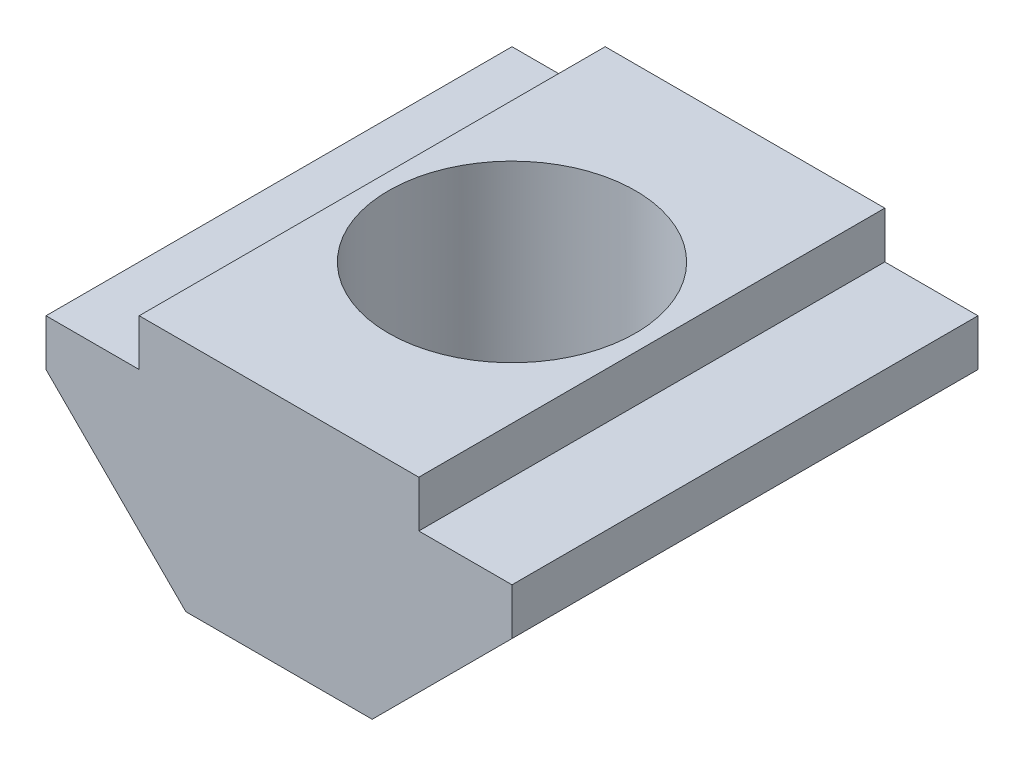
ISO-10303-21;
HEADER;
FILE_DESCRIPTION(('STEP AP214'),'2;1');
FILE_NAME('part.step','',(''),(''),'','','');
FILE_SCHEMA(('AUTOMOTIVE_DESIGN { 1 0 10303 214 1 1 1 1 }'));
ENDSEC;
DATA;
#1=APPLICATION_CONTEXT('core data for automotive mechanical design processes');
#2=APPLICATION_PROTOCOL_DEFINITION('international standard','automotive_design',2000,#1);
#3=PRODUCT_CONTEXT('',#1,'mechanical');
#4=PRODUCT('Part','Part','',(#3));
#5=PRODUCT_RELATED_PRODUCT_CATEGORY('part','',(#4));
#6=PRODUCT_DEFINITION_FORMATION('','',#4);
#7=PRODUCT_DEFINITION_CONTEXT('part definition',#1,'design');
#8=PRODUCT_DEFINITION('design','',#6,#7);
#9=PRODUCT_DEFINITION_SHAPE('','',#8);
#10=(LENGTH_UNIT() NAMED_UNIT(*) SI_UNIT(.MILLI.,.METRE.));
#11=(NAMED_UNIT(*) PLANE_ANGLE_UNIT() SI_UNIT($,.RADIAN.));
#12=(NAMED_UNIT(*) SI_UNIT($,.STERADIAN.) SOLID_ANGLE_UNIT());
#13=UNCERTAINTY_MEASURE_WITH_UNIT(LENGTH_MEASURE(1.E-05),#10,'distance_accuracy_value','');
#14=(GEOMETRIC_REPRESENTATION_CONTEXT(3) GLOBAL_UNCERTAINTY_ASSIGNED_CONTEXT((#13)) GLOBAL_UNIT_ASSIGNED_CONTEXT((#10,
#11,#12)) REPRESENTATION_CONTEXT('',''));
#15=CARTESIAN_POINT('',(0.,0.,0.));
#16=DIRECTION('',(0.,0.,1.));
#17=DIRECTION('',(1.,0.,0.));
#18=AXIS2_PLACEMENT_3D('',#15,#16,#17);
#19=CARTESIAN_POINT('',(0.,-2.50000000000001,-5.));
#20=DIRECTION('',(0.,-1.,0.));
#21=DIRECTION('',(0.,0.,-1.));
#22=AXIS2_PLACEMENT_3D('',#19,#20,#21);
#23=PLANE('',#22);
#24=CARTESIAN_POINT('',(0.,-2.50000000000001,0.));
#25=DIRECTION('',(0.,-1.,0.));
#26=DIRECTION('',(0.,0.,-1.));
#27=AXIS2_PLACEMENT_3D('',#24,#25,#26);
#28=CIRCLE('',#27,2.65);
#29=CARTESIAN_POINT('',(2.00000000000002,-2.50000000000001,1.73853386507134));
#30=VERTEX_POINT('',#29);
#31=CARTESIAN_POINT('',(-2.,-2.50000000000001,1.73853386507136));
#32=VERTEX_POINT('',#31);
#33=EDGE_CURVE('E11',#30,#32,#28,.T.);
#34=ORIENTED_EDGE('',*,*,#33,.F.);
#35=DIRECTION('',(0.,0.,1.));
#36=VECTOR('',#35,1.);
#37=CARTESIAN_POINT('',(2.00000000000002,-2.50000000000001,-5.));
#38=LINE('',#37,#36);
#39=CARTESIAN_POINT('',(2.00000000000002,-2.50000000000001,5.));
#40=VERTEX_POINT('',#39);
#41=EDGE_CURVE('E142',#30,#40,#38,.T.);
#42=ORIENTED_EDGE('',*,*,#41,.T.);
#43=DIRECTION('',(1.,0.,0.));
#44=VECTOR('',#43,1.);
#45=CARTESIAN_POINT('',(0.,-2.50000000000001,5.));
#46=LINE('',#45,#44);
#47=CARTESIAN_POINT('',(-2.,-2.50000000000001,5.));
#48=VERTEX_POINT('',#47);
#49=EDGE_CURVE('E246',#48,#40,#46,.T.);
#50=ORIENTED_EDGE('',*,*,#49,.F.);
#51=DIRECTION('',(0.,0.,1.));
#52=VECTOR('',#51,1.);
#53=CARTESIAN_POINT('',(-2.,-2.50000000000001,-5.));
#54=LINE('',#53,#52);
#55=EDGE_CURVE('E175',#32,#48,#54,.T.);
#56=ORIENTED_EDGE('',*,*,#55,.F.);
#57=EDGE_LOOP('',(#34,#42,#50,#56));
#58=FACE_BOUND('',#57,.T.);
#59=ADVANCED_FACE('F41',(#58),#23,.T.);
#60=CARTESIAN_POINT('',(-2.,-2.50000000000001,-1.73853386507136));
#61=VERTEX_POINT('',#60);
#62=CARTESIAN_POINT('',(2.00000000000002,-2.50000000000001,-1.73853386507134));
#63=VERTEX_POINT('',#62);
#64=EDGE_CURVE('E45',#61,#63,#28,.T.);
#65=ORIENTED_EDGE('',*,*,#64,.F.);
#66=CARTESIAN_POINT('',(-2.,-2.50000000000001,-5.));
#67=VERTEX_POINT('',#66);
#68=EDGE_CURVE('E63',#67,#61,#54,.T.);
#69=ORIENTED_EDGE('',*,*,#68,.F.);
#70=DIRECTION('',(1.,0.,0.));
#71=VECTOR('',#70,1.);
#72=CARTESIAN_POINT('',(0.,-2.50000000000001,-5.));
#73=LINE('',#72,#71);
#74=CARTESIAN_POINT('',(2.00000000000002,-2.50000000000001,-5.));
#75=VERTEX_POINT('',#74);
#76=EDGE_CURVE('E146',#67,#75,#73,.T.);
#77=ORIENTED_EDGE('',*,*,#76,.T.);
#78=EDGE_CURVE('E139',#75,#63,#38,.T.);
#79=ORIENTED_EDGE('',*,*,#78,.T.);
#80=EDGE_LOOP('',(#65,#69,#77,#79));
#81=FACE_BOUND('',#80,.T.);
#82=ADVANCED_FACE('F43',(#81),#23,.T.);
#83=CARTESIAN_POINT('',(-2.25000000000001,-2.25,-5.));
#84=DIRECTION('',(-0.707106781186549,-0.707106781186546,0.));
#85=DIRECTION('',(0.707106781186546,-0.707106781186549,0.));
#86=AXIS2_PLACEMENT_3D('',#83,#84,#85);
#87=PLANE('',#86);
#88=CARTESIAN_POINT('',(0.,-4.50000000000002,0.));
#89=DIRECTION('',(-0.707106781186549,-0.707106781186546,0.));
#90=DIRECTION('',(-0.707106781186546,0.707106781186549,0.));
#91=AXIS2_PLACEMENT_3D('',#88,#89,#90);
#92=ELLIPSE('',#91,3.7476659402887,2.65);
#93=EDGE_CURVE('E56',#32,#61,#92,.T.);
#94=ORIENTED_EDGE('',*,*,#93,.F.);
#95=ORIENTED_EDGE('',*,*,#55,.T.);
#96=DIRECTION('',(0.707106781186546,-0.707106781186549,0.));
#97=VECTOR('',#96,1.);
#98=CARTESIAN_POINT('',(-2.25000000000001,-2.25,5.));
#99=LINE('',#98,#97);
#100=CARTESIAN_POINT('',(-5.,0.499999999999993,5.));
#101=VERTEX_POINT('',#100);
#102=EDGE_CURVE('E210',#101,#48,#99,.T.);
#103=ORIENTED_EDGE('',*,*,#102,.F.);
#104=DIRECTION('',(0.,0.,1.));
#105=VECTOR('',#104,1.);
#106=CARTESIAN_POINT('',(-5.,0.499999999999993,-5.));
#107=LINE('',#106,#105);
#108=CARTESIAN_POINT('',(-5.,0.499999999999993,-5.));
#109=VERTEX_POINT('',#108);
#110=EDGE_CURVE('E172',#109,#101,#107,.T.);
#111=ORIENTED_EDGE('',*,*,#110,.F.);
#112=DIRECTION('',(0.707106781186546,-0.707106781186549,0.));
#113=VECTOR('',#112,1.);
#114=CARTESIAN_POINT('',(-2.25000000000001,-2.25,-5.));
#115=LINE('',#114,#113);
#116=EDGE_CURVE('E153',#109,#67,#115,.T.);
#117=ORIENTED_EDGE('',*,*,#116,.T.);
#118=ORIENTED_EDGE('',*,*,#68,.T.);
#119=EDGE_LOOP('',(#94,#95,#103,#111,#117,#118));
#120=FACE_BOUND('',#119,.T.);
#121=ADVANCED_FACE('F292',(#120),#87,.T.);
#122=CARTESIAN_POINT('',(-5.,0.,-5.));
#123=DIRECTION('',(1.,0.,0.));
#124=DIRECTION('',(0.,0.,-1.));
#125=AXIS2_PLACEMENT_3D('',#122,#123,#124);
#126=PLANE('',#125);
#127=ORIENTED_EDGE('',*,*,#110,.T.);
#128=DIRECTION('',(0.,1.,0.));
#129=VECTOR('',#128,1.);
#130=CARTESIAN_POINT('',(-5.,0.,5.));
#131=LINE('',#130,#129);
#132=CARTESIAN_POINT('',(-5.,1.5,5.));
#133=VERTEX_POINT('',#132);
#134=EDGE_CURVE('E214',#101,#133,#131,.T.);
#135=ORIENTED_EDGE('',*,*,#134,.T.);
#136=DIRECTION('',(0.,0.,1.));
#137=VECTOR('',#136,1.);
#138=CARTESIAN_POINT('',(-5.,1.5,-5.));
#139=LINE('',#138,#137);
#140=CARTESIAN_POINT('',(-5.,1.5,-5.));
#141=VERTEX_POINT('',#140);
#142=EDGE_CURVE('E169',#141,#133,#139,.T.);
#143=ORIENTED_EDGE('',*,*,#142,.F.);
#144=DIRECTION('',(0.,1.,0.));
#145=VECTOR('',#144,1.);
#146=CARTESIAN_POINT('',(-5.,0.,-5.));
#147=LINE('',#146,#145);
#148=EDGE_CURVE('E181',#109,#141,#147,.T.);
#149=ORIENTED_EDGE('',*,*,#148,.F.);
#150=EDGE_LOOP('',(#127,#135,#143,#149));
#151=FACE_BOUND('',#150,.T.);
#152=ADVANCED_FACE('F289',(#151),#126,.F.);
#153=CARTESIAN_POINT('',(0.,1.5,-5.));
#154=DIRECTION('',(0.,1.,0.));
#155=DIRECTION('',(-1.,0.,0.));
#156=AXIS2_PLACEMENT_3D('',#153,#154,#155);
#157=PLANE('',#156);
#158=ORIENTED_EDGE('',*,*,#142,.T.);
#159=DIRECTION('',(-1.,0.,0.));
#160=VECTOR('',#159,1.);
#161=CARTESIAN_POINT('',(0.,1.5,5.));
#162=LINE('',#161,#160);
#163=CARTESIAN_POINT('',(-3.,1.5,5.));
#164=VERTEX_POINT('',#163);
#165=EDGE_CURVE('E218',#164,#133,#162,.T.);
#166=ORIENTED_EDGE('',*,*,#165,.F.);
#167=DIRECTION('',(0.,0.,1.));
#168=VECTOR('',#167,1.);
#169=CARTESIAN_POINT('',(-3.,1.5,-5.));
#170=LINE('',#169,#168);
#171=CARTESIAN_POINT('',(-3.,1.5,-5.));
#172=VERTEX_POINT('',#171);
#173=EDGE_CURVE('E166',#172,#164,#170,.T.);
#174=ORIENTED_EDGE('',*,*,#173,.F.);
#175=DIRECTION('',(-1.,0.,0.));
#176=VECTOR('',#175,1.);
#177=CARTESIAN_POINT('',(0.,1.5,-5.));
#178=LINE('',#177,#176);
#179=EDGE_CURVE('E184',#172,#141,#178,.T.);
#180=ORIENTED_EDGE('',*,*,#179,.T.);
#181=EDGE_LOOP('',(#158,#166,#174,#180));
#182=FACE_BOUND('',#181,.T.);
#183=ADVANCED_FACE('F286',(#182),#157,.T.);
#184=CARTESIAN_POINT('',(-3.,0.,-5.));
#185=DIRECTION('',(-1.,0.,0.));
#186=DIRECTION('',(0.,0.,1.));
#187=AXIS2_PLACEMENT_3D('',#184,#185,#186);
#188=PLANE('',#187);
#189=ORIENTED_EDGE('',*,*,#173,.T.);
#190=DIRECTION('',(0.,-1.,0.));
#191=VECTOR('',#190,1.);
#192=CARTESIAN_POINT('',(-3.,0.,5.));
#193=LINE('',#192,#191);
#194=CARTESIAN_POINT('',(-3.,2.49999999999999,5.));
#195=VERTEX_POINT('',#194);
#196=EDGE_CURVE('E222',#195,#164,#193,.T.);
#197=ORIENTED_EDGE('',*,*,#196,.F.);
#198=DIRECTION('',(0.,0.,1.));
#199=VECTOR('',#198,1.);
#200=CARTESIAN_POINT('',(-3.,2.49999999999999,-5.));
#201=LINE('',#200,#199);
#202=CARTESIAN_POINT('',(-3.,2.49999999999999,-5.));
#203=VERTEX_POINT('',#202);
#204=EDGE_CURVE('E163',#203,#195,#201,.T.);
#205=ORIENTED_EDGE('',*,*,#204,.F.);
#206=DIRECTION('',(0.,-1.,0.));
#207=VECTOR('',#206,1.);
#208=CARTESIAN_POINT('',(-3.,0.,-5.));
#209=LINE('',#208,#207);
#210=EDGE_CURVE('E188',#203,#172,#209,.T.);
#211=ORIENTED_EDGE('',*,*,#210,.T.);
#212=EDGE_LOOP('',(#189,#197,#205,#211));
#213=FACE_BOUND('',#212,.T.);
#214=ADVANCED_FACE('F260',(#213),#188,.T.);
#215=CARTESIAN_POINT('',(0.,2.49999999999999,-5.));
#216=DIRECTION('',(0.,-1.,0.));
#217=DIRECTION('',(0.,0.,-1.));
#218=AXIS2_PLACEMENT_3D('',#215,#216,#217);
#219=PLANE('',#218);
#220=CARTESIAN_POINT('',(0.,2.49999999999999,0.));
#221=DIRECTION('',(0.,1.,0.));
#222=DIRECTION('',(0.,0.,1.));
#223=AXIS2_PLACEMENT_3D('',#220,#221,#222);
#224=CIRCLE('',#223,2.65);
#225=CARTESIAN_POINT('',(0.,2.49999999999999,2.65));
#226=VERTEX_POINT('',#225);
#227=EDGE_CURVE('E144',#226,#226,#224,.T.);
#228=ORIENTED_EDGE('',*,*,#227,.F.);
#229=EDGE_LOOP('',(#228));
#230=FACE_BOUND('',#229,.T.);
#231=ORIENTED_EDGE('',*,*,#204,.T.);
#232=DIRECTION('',(1.,0.,0.));
#233=VECTOR('',#232,1.);
#234=CARTESIAN_POINT('',(0.,2.49999999999999,5.));
#235=LINE('',#234,#233);
#236=CARTESIAN_POINT('',(3.,2.49999999999999,5.));
#237=VERTEX_POINT('',#236);
#238=EDGE_CURVE('E226',#195,#237,#235,.T.);
#239=ORIENTED_EDGE('',*,*,#238,.T.);
#240=DIRECTION('',(0.,0.,1.));
#241=VECTOR('',#240,1.);
#242=CARTESIAN_POINT('',(3.,2.49999999999999,-5.));
#243=LINE('',#242,#241);
#244=CARTESIAN_POINT('',(3.,2.49999999999999,-5.));
#245=VERTEX_POINT('',#244);
#246=EDGE_CURVE('E160',#245,#237,#243,.T.);
#247=ORIENTED_EDGE('',*,*,#246,.F.);
#248=DIRECTION('',(1.,0.,0.));
#249=VECTOR('',#248,1.);
#250=CARTESIAN_POINT('',(0.,2.49999999999999,-5.));
#251=LINE('',#250,#249);
#252=EDGE_CURVE('E192',#203,#245,#251,.T.);
#253=ORIENTED_EDGE('',*,*,#252,.F.);
#254=EDGE_LOOP('',(#231,#239,#247,#253));
#255=FACE_BOUND('',#254,.T.);
#256=ADVANCED_FACE('F256',(#230,#255),#219,.F.);
#257=CARTESIAN_POINT('',(3.,0.,-5.));
#258=DIRECTION('',(-1.,0.,0.));
#259=DIRECTION('',(0.,-1.,0.));
#260=AXIS2_PLACEMENT_3D('',#257,#258,#259);
#261=PLANE('',#260);
#262=ORIENTED_EDGE('',*,*,#246,.T.);
#263=DIRECTION('',(0.,-1.,0.));
#264=VECTOR('',#263,1.);
#265=CARTESIAN_POINT('',(3.,0.,5.));
#266=LINE('',#265,#264);
#267=CARTESIAN_POINT('',(3.,1.49999999999999,5.));
#268=VERTEX_POINT('',#267);
#269=EDGE_CURVE('E230',#237,#268,#266,.T.);
#270=ORIENTED_EDGE('',*,*,#269,.T.);
#271=DIRECTION('',(0.,0.,1.));
#272=VECTOR('',#271,1.);
#273=CARTESIAN_POINT('',(3.,1.49999999999999,-5.));
#274=LINE('',#273,#272);
#275=CARTESIAN_POINT('',(3.,1.49999999999999,-5.));
#276=VERTEX_POINT('',#275);
#277=EDGE_CURVE('E157',#276,#268,#274,.T.);
#278=ORIENTED_EDGE('',*,*,#277,.F.);
#279=DIRECTION('',(0.,-1.,0.));
#280=VECTOR('',#279,1.);
#281=CARTESIAN_POINT('',(3.,0.,-5.));
#282=LINE('',#281,#280);
#283=EDGE_CURVE('E195',#245,#276,#282,.T.);
#284=ORIENTED_EDGE('',*,*,#283,.F.);
#285=EDGE_LOOP('',(#262,#270,#278,#284));
#286=FACE_BOUND('',#285,.T.);
#287=ADVANCED_FACE('F259',(#286),#261,.F.);
#288=CARTESIAN_POINT('',(0.,1.49999999999999,-5.));
#289=DIRECTION('',(0.,-1.,0.));
#290=DIRECTION('',(0.,0.,-1.));
#291=AXIS2_PLACEMENT_3D('',#288,#289,#290);
#292=PLANE('',#291);
#293=ORIENTED_EDGE('',*,*,#277,.T.);
#294=DIRECTION('',(1.,0.,0.));
#295=VECTOR('',#294,1.);
#296=CARTESIAN_POINT('',(0.,1.49999999999999,5.));
#297=LINE('',#296,#295);
#298=CARTESIAN_POINT('',(5.,1.49999999999999,5.));
#299=VERTEX_POINT('',#298);
#300=EDGE_CURVE('E234',#268,#299,#297,.T.);
#301=ORIENTED_EDGE('',*,*,#300,.T.);
#302=DIRECTION('',(0.,0.,1.));
#303=VECTOR('',#302,1.);
#304=CARTESIAN_POINT('',(5.,1.49999999999999,-5.));
#305=LINE('',#304,#303);
#306=CARTESIAN_POINT('',(5.,1.49999999999999,-5.));
#307=VERTEX_POINT('',#306);
#308=EDGE_CURVE('E151',#307,#299,#305,.T.);
#309=ORIENTED_EDGE('',*,*,#308,.F.);
#310=DIRECTION('',(1.,0.,0.));
#311=VECTOR('',#310,1.);
#312=CARTESIAN_POINT('',(0.,1.49999999999999,-5.));
#313=LINE('',#312,#311);
#314=EDGE_CURVE('E198',#276,#307,#313,.T.);
#315=ORIENTED_EDGE('',*,*,#314,.F.);
#316=EDGE_LOOP('',(#293,#301,#309,#315));
#317=FACE_BOUND('',#316,.T.);
#318=ADVANCED_FACE('F300',(#317),#292,.F.);
#319=CARTESIAN_POINT('',(5.,0.,-5.));
#320=DIRECTION('',(1.,0.,0.));
#321=DIRECTION('',(0.,0.,-1.));
#322=AXIS2_PLACEMENT_3D('',#319,#320,#321);
#323=PLANE('',#322);
#324=ORIENTED_EDGE('',*,*,#308,.T.);
#325=DIRECTION('',(0.,1.,0.));
#326=VECTOR('',#325,1.);
#327=CARTESIAN_POINT('',(5.,0.,5.));
#328=LINE('',#327,#326);
#329=CARTESIAN_POINT('',(5.,0.499999999999989,5.));
#330=VERTEX_POINT('',#329);
#331=EDGE_CURVE('E238',#330,#299,#328,.T.);
#332=ORIENTED_EDGE('',*,*,#331,.F.);
#333=DIRECTION('',(0.,0.,1.));
#334=VECTOR('',#333,1.);
#335=CARTESIAN_POINT('',(5.,0.499999999999989,-5.));
#336=LINE('',#335,#334);
#337=CARTESIAN_POINT('',(5.,0.499999999999989,-5.));
#338=VERTEX_POINT('',#337);
#339=EDGE_CURVE('E148',#338,#330,#336,.T.);
#340=ORIENTED_EDGE('',*,*,#339,.F.);
#341=DIRECTION('',(0.,1.,0.));
#342=VECTOR('',#341,1.);
#343=CARTESIAN_POINT('',(5.,0.,-5.));
#344=LINE('',#343,#342);
#345=EDGE_CURVE('E201',#338,#307,#344,.T.);
#346=ORIENTED_EDGE('',*,*,#345,.T.);
#347=EDGE_LOOP('',(#324,#332,#340,#346));
#348=FACE_BOUND('',#347,.T.);
#349=ADVANCED_FACE('F298',(#348),#323,.T.);
#350=CARTESIAN_POINT('',(2.25000000000002,-2.25000000000001,-5.));
#351=DIRECTION('',(0.707106781186549,-0.707106781186546,0.));
#352=DIRECTION('',(0.707106781186546,0.707106781186549,0.));
#353=AXIS2_PLACEMENT_3D('',#350,#351,#352);
#354=PLANE('',#353);
#355=CARTESIAN_POINT('',(0.,-4.50000000000003,0.));
#356=DIRECTION('',(0.707106781186549,-0.707106781186546,0.));
#357=DIRECTION('',(0.707106781186546,0.707106781186549,0.));
#358=AXIS2_PLACEMENT_3D('',#355,#356,#357);
#359=ELLIPSE('',#358,3.7476659402887,2.65);
#360=EDGE_CURVE('E131',#63,#30,#359,.T.);
#361=ORIENTED_EDGE('',*,*,#360,.F.);
#362=ORIENTED_EDGE('',*,*,#78,.F.);
#363=DIRECTION('',(0.707106781186546,0.707106781186549,0.));
#364=VECTOR('',#363,1.);
#365=CARTESIAN_POINT('',(2.25000000000002,-2.25000000000001,-5.));
#366=LINE('',#365,#364);
#367=EDGE_CURVE('E205',#75,#338,#366,.T.);
#368=ORIENTED_EDGE('',*,*,#367,.T.);
#369=ORIENTED_EDGE('',*,*,#339,.T.);
#370=DIRECTION('',(0.707106781186546,0.707106781186549,0.));
#371=VECTOR('',#370,1.);
#372=CARTESIAN_POINT('',(2.25000000000002,-2.25000000000001,5.));
#373=LINE('',#372,#371);
#374=EDGE_CURVE('E242',#40,#330,#373,.T.);
#375=ORIENTED_EDGE('',*,*,#374,.F.);
#376=ORIENTED_EDGE('',*,*,#41,.F.);
#377=EDGE_LOOP('',(#361,#362,#368,#369,#375,#376));
#378=FACE_BOUND('',#377,.T.);
#379=ADVANCED_FACE('F137',(#378),#354,.T.);
#380=CARTESIAN_POINT('',(0.,0.,-5.));
#381=DIRECTION('',(0.,0.,1.));
#382=DIRECTION('',(1.,0.,0.));
#383=AXIS2_PLACEMENT_3D('',#380,#381,#382);
#384=PLANE('',#383);
#385=ORIENTED_EDGE('',*,*,#76,.F.);
#386=ORIENTED_EDGE('',*,*,#116,.F.);
#387=ORIENTED_EDGE('',*,*,#148,.T.);
#388=ORIENTED_EDGE('',*,*,#179,.F.);
#389=ORIENTED_EDGE('',*,*,#210,.F.);
#390=ORIENTED_EDGE('',*,*,#252,.T.);
#391=ORIENTED_EDGE('',*,*,#283,.T.);
#392=ORIENTED_EDGE('',*,*,#314,.T.);
#393=ORIENTED_EDGE('',*,*,#345,.F.);
#394=ORIENTED_EDGE('',*,*,#367,.F.);
#395=EDGE_LOOP('',(#385,#386,#387,#388,#389,#390,#391,#392,#393,#394));
#396=FACE_BOUND('',#395,.T.);
#397=ADVANCED_FACE('F278',(#396),#384,.F.);
#398=CARTESIAN_POINT('',(0.,0.,5.));
#399=DIRECTION('',(0.,0.,1.));
#400=DIRECTION('',(1.,0.,0.));
#401=AXIS2_PLACEMENT_3D('',#398,#399,#400);
#402=PLANE('',#401);
#403=ORIENTED_EDGE('',*,*,#49,.T.);
#404=ORIENTED_EDGE('',*,*,#374,.T.);
#405=ORIENTED_EDGE('',*,*,#331,.T.);
#406=ORIENTED_EDGE('',*,*,#300,.F.);
#407=ORIENTED_EDGE('',*,*,#269,.F.);
#408=ORIENTED_EDGE('',*,*,#238,.F.);
#409=ORIENTED_EDGE('',*,*,#196,.T.);
#410=ORIENTED_EDGE('',*,*,#165,.T.);
#411=ORIENTED_EDGE('',*,*,#134,.F.);
#412=ORIENTED_EDGE('',*,*,#102,.T.);
#413=EDGE_LOOP('',(#403,#404,#405,#406,#407,#408,#409,#410,#411,#412));
#414=FACE_BOUND('',#413,.T.);
#415=ADVANCED_FACE('F271',(#414),#402,.T.);
#416=CARTESIAN_POINT('',(0.,2.49999999999999,0.));
#417=DIRECTION('',(0.,1.,0.));
#418=DIRECTION('',(0.,0.,1.));
#419=AXIS2_PLACEMENT_3D('',#416,#417,#418);
#420=CYLINDRICAL_SURFACE('',#419,2.65);
#421=ORIENTED_EDGE('',*,*,#33,.T.);
#422=ORIENTED_EDGE('',*,*,#93,.T.);
#423=ORIENTED_EDGE('',*,*,#64,.T.);
#424=ORIENTED_EDGE('',*,*,#360,.T.);
#425=EDGE_LOOP('',(#421,#422,#423,#424));
#426=FACE_BOUND('',#425,.T.);
#427=ORIENTED_EDGE('',*,*,#227,.T.);
#428=EDGE_LOOP('',(#427));
#429=FACE_BOUND('',#428,.T.);
#430=ADVANCED_FACE('F129',(#426,#429),#420,.F.);
#431=CLOSED_SHELL('',(#59,#82,#121,#152,#183,#214,#256,#287,#318,#349,#379,#397,#415,#430));
#432=MANIFOLD_SOLID_BREP('B2',#431);
#433=ADVANCED_BREP_SHAPE_REPRESENTATION('',(#18,#432),#14);
#434=SHAPE_DEFINITION_REPRESENTATION(#9,#433);
ENDSEC;
END-ISO-10303-21;
